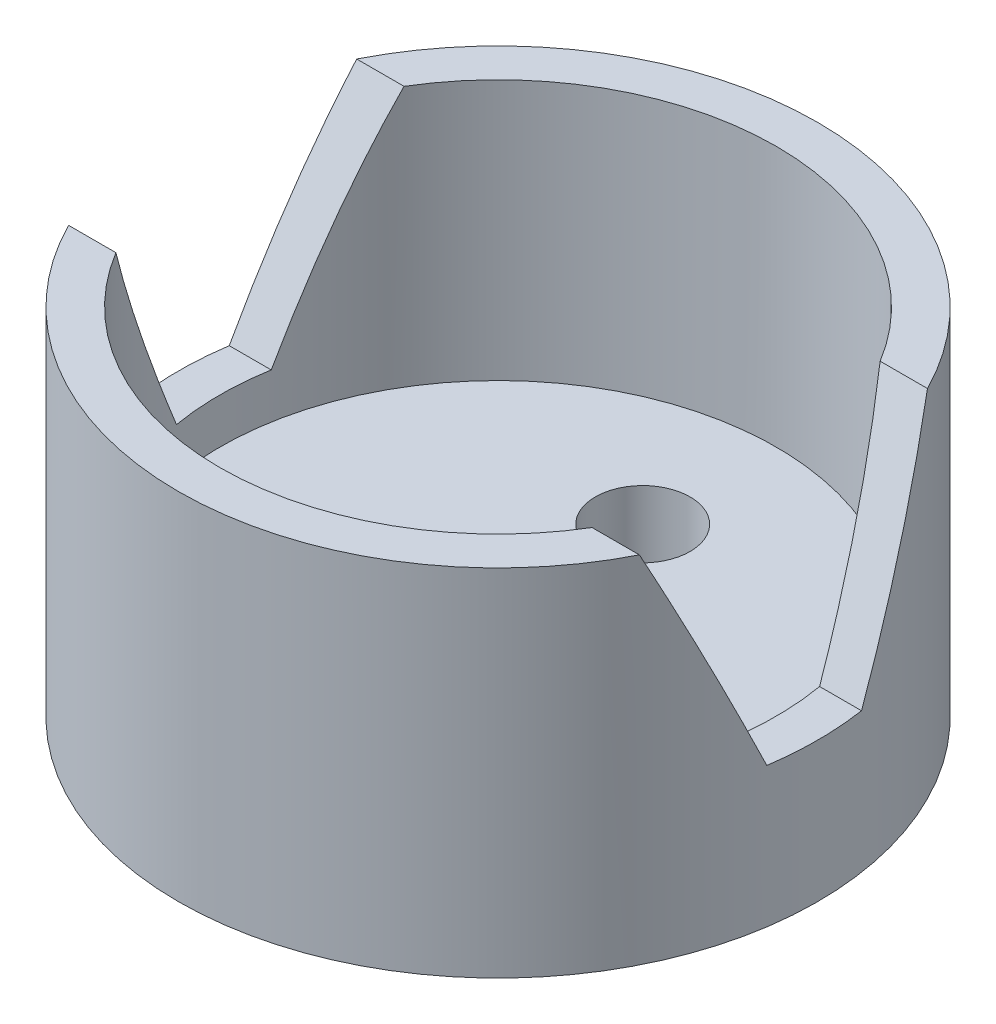
ISO-10303-21;
HEADER;
FILE_DESCRIPTION(('STEP AP214'),'2;1');
FILE_NAME('part.step','',(''),(''),'','','');
FILE_SCHEMA(('AUTOMOTIVE_DESIGN { 1 0 10303 214 1 1 1 1 }'));
ENDSEC;
DATA;
#1=APPLICATION_CONTEXT('core data for automotive mechanical design processes');
#2=APPLICATION_PROTOCOL_DEFINITION('international standard','automotive_design',2000,#1);
#3=PRODUCT_CONTEXT('',#1,'mechanical');
#4=PRODUCT('Part','Part','',(#3));
#5=PRODUCT_RELATED_PRODUCT_CATEGORY('part','',(#4));
#6=PRODUCT_DEFINITION_FORMATION('','',#4);
#7=PRODUCT_DEFINITION_CONTEXT('part definition',#1,'design');
#8=PRODUCT_DEFINITION('design','',#6,#7);
#9=PRODUCT_DEFINITION_SHAPE('','',#8);
#10=(LENGTH_UNIT() NAMED_UNIT(*) SI_UNIT(.MILLI.,.METRE.));
#11=(NAMED_UNIT(*) PLANE_ANGLE_UNIT() SI_UNIT($,.RADIAN.));
#12=(NAMED_UNIT(*) SI_UNIT($,.STERADIAN.) SOLID_ANGLE_UNIT());
#13=UNCERTAINTY_MEASURE_WITH_UNIT(LENGTH_MEASURE(1.E-05),#10,'distance_accuracy_value','');
#14=(GEOMETRIC_REPRESENTATION_CONTEXT(3) GLOBAL_UNCERTAINTY_ASSIGNED_CONTEXT((#13)) GLOBAL_UNIT_ASSIGNED_CONTEXT((#10,
#11,#12)) REPRESENTATION_CONTEXT('',''));
#15=CARTESIAN_POINT('',(0.,0.,0.));
#16=DIRECTION('',(0.,0.,1.));
#17=DIRECTION('',(1.,0.,0.));
#18=AXIS2_PLACEMENT_3D('',#15,#16,#17);
#19=CARTESIAN_POINT('',(0.,15.,0.));
#20=DIRECTION('',(0.,1.,0.));
#21=DIRECTION('',(0.,0.,1.));
#22=AXIS2_PLACEMENT_3D('',#19,#20,#21);
#23=PLANE('',#22);
#24=DIRECTION('',(1.,0.,0.));
#25=VECTOR('',#24,1.);
#26=CARTESIAN_POINT('',(-13.5,15.,-6.0831228610285));
#27=LINE('',#26,#25);
#28=CARTESIAN_POINT('',(10.0527665971927,15.,-6.0831228610285));
#29=VERTEX_POINT('',#28);
#30=CARTESIAN_POINT('',(12.0517889235429,15.,-6.0831228610285));
#31=VERTEX_POINT('',#30);
#32=EDGE_CURVE('E140',#29,#31,#27,.T.);
#33=ORIENTED_EDGE('',*,*,#32,.T.);
#34=CARTESIAN_POINT('',(0.,15.,0.));
#35=DIRECTION('',(0.,1.,0.));
#36=DIRECTION('',(0.,0.,1.));
#37=AXIS2_PLACEMENT_3D('',#34,#35,#36);
#38=CIRCLE('',#37,13.5);
#39=CARTESIAN_POINT('',(-12.0517889235429,15.,-6.0831228610285));
#40=VERTEX_POINT('',#39);
#41=EDGE_CURVE('E171',#31,#40,#38,.T.);
#42=ORIENTED_EDGE('',*,*,#41,.T.);
#43=CARTESIAN_POINT('',(-10.0527665971927,15.,-6.0831228610285));
#44=VERTEX_POINT('',#43);
#45=EDGE_CURVE('E135',#40,#44,#27,.T.);
#46=ORIENTED_EDGE('',*,*,#45,.T.);
#47=CARTESIAN_POINT('',(0.,15.,0.));
#48=DIRECTION('',(0.,1.,0.));
#49=DIRECTION('',(0.,0.,1.));
#50=AXIS2_PLACEMENT_3D('',#47,#48,#49);
#51=CIRCLE('',#50,11.75);
#52=EDGE_CURVE('E165',#29,#44,#51,.T.);
#53=ORIENTED_EDGE('',*,*,#52,.F.);
#54=EDGE_LOOP('',(#33,#42,#46,#53));
#55=FACE_BOUND('',#54,.T.);
#56=ADVANCED_FACE('F39',(#55),#23,.T.);
#57=CARTESIAN_POINT('',(0.,15.,0.));
#58=DIRECTION('',(0.,-1.,0.));
#59=DIRECTION('',(0.,0.,-1.));
#60=AXIS2_PLACEMENT_3D('',#57,#58,#59);
#61=CYLINDRICAL_SURFACE('',#60,13.5);
#62=ORIENTED_EDGE('',*,*,#41,.F.);
#63=CARTESIAN_POINT('',(0.,1.45377772708866,0.));
#64=DIRECTION('',(0.,-0.409654602258446,-0.91224070663859));
#65=DIRECTION('',(0.,-0.91224070663859,0.409654602258446));
#66=AXIS2_PLACEMENT_3D('',#63,#64,#65);
#67=ELLIPSE('',#66,32.9545913205267,13.5);
#68=CARTESIAN_POINT('',(13.3510299228187,5.90748434534395,-2.));
#69=VERTEX_POINT('',#68);
#70=EDGE_CURVE('E146',#31,#69,#67,.T.);
#71=ORIENTED_EDGE('',*,*,#70,.T.);
#72=CARTESIAN_POINT('',(0.,5.90748434534395,0.));
#73=DIRECTION('',(0.,-1.,0.));
#74=DIRECTION('',(0.,0.,-1.));
#75=AXIS2_PLACEMENT_3D('',#72,#73,#74);
#76=CIRCLE('',#75,13.5);
#77=CARTESIAN_POINT('',(13.3510299228187,5.90748434534395,2.));
#78=VERTEX_POINT('',#77);
#79=EDGE_CURVE('E119',#69,#78,#76,.T.);
#80=ORIENTED_EDGE('',*,*,#79,.T.);
#81=CARTESIAN_POINT('',(0.,1.45377772708866,0.));
#82=DIRECTION('',(0.,-0.409654602258446,0.91224070663859));
#83=DIRECTION('',(0.,-0.91224070663859,-0.409654602258446));
#84=AXIS2_PLACEMENT_3D('',#81,#82,#83);
#85=ELLIPSE('',#84,32.9545913205267,13.5);
#86=CARTESIAN_POINT('',(12.0517889235429,15.,6.0831228610285));
#87=VERTEX_POINT('',#86);
#88=EDGE_CURVE('E120',#78,#87,#85,.T.);
#89=ORIENTED_EDGE('',*,*,#88,.T.);
#90=CARTESIAN_POINT('',(-12.0517889235429,15.,6.0831228610285));
#91=VERTEX_POINT('',#90);
#92=EDGE_CURVE('E133',#91,#87,#38,.T.);
#93=ORIENTED_EDGE('',*,*,#92,.F.);
#94=CARTESIAN_POINT('',(-13.3510299228187,5.90748434534395,2.));
#95=VERTEX_POINT('',#94);
#96=EDGE_CURVE('E123',#91,#95,#85,.T.);
#97=ORIENTED_EDGE('',*,*,#96,.T.);
#98=CARTESIAN_POINT('',(-13.3510299228187,5.90748434534395,-2.));
#99=VERTEX_POINT('',#98);
#100=EDGE_CURVE('E107',#95,#99,#76,.T.);
#101=ORIENTED_EDGE('',*,*,#100,.T.);
#102=EDGE_CURVE('E150',#99,#40,#67,.T.);
#103=ORIENTED_EDGE('',*,*,#102,.T.);
#104=EDGE_LOOP('',(#62,#71,#80,#89,#93,#97,#101,#103));
#105=FACE_BOUND('',#104,.T.);
#106=CARTESIAN_POINT('',(0.,0.,0.));
#107=DIRECTION('',(0.,1.,0.));
#108=DIRECTION('',(0.,0.,1.));
#109=AXIS2_PLACEMENT_3D('',#106,#107,#108);
#110=CIRCLE('',#109,13.5);
#111=CARTESIAN_POINT('',(0.,0.,13.5));
#112=VERTEX_POINT('',#111);
#113=EDGE_CURVE('E164',#112,#112,#110,.T.);
#114=ORIENTED_EDGE('',*,*,#113,.T.);
#115=EDGE_LOOP('',(#114));
#116=FACE_BOUND('',#115,.T.);
#117=ADVANCED_FACE('F41',(#105,#116),#61,.T.);
#118=DIRECTION('',(1.,0.,0.));
#119=VECTOR('',#118,1.);
#120=CARTESIAN_POINT('',(-13.5,15.,6.0831228610285));
#121=LINE('',#120,#119);
#122=CARTESIAN_POINT('',(-10.0527665971927,15.,6.0831228610285));
#123=VERTEX_POINT('',#122);
#124=EDGE_CURVE('E64',#91,#123,#121,.T.);
#125=ORIENTED_EDGE('',*,*,#124,.F.);
#126=ORIENTED_EDGE('',*,*,#92,.T.);
#127=CARTESIAN_POINT('',(10.0527665971927,15.,6.0831228610285));
#128=VERTEX_POINT('',#127);
#129=EDGE_CURVE('E143',#128,#87,#121,.T.);
#130=ORIENTED_EDGE('',*,*,#129,.F.);
#131=EDGE_CURVE('E155',#123,#128,#51,.T.);
#132=ORIENTED_EDGE('',*,*,#131,.F.);
#133=EDGE_LOOP('',(#125,#126,#130,#132));
#134=FACE_BOUND('',#133,.T.);
#135=ADVANCED_FACE('F191',(#134),#23,.T.);
#136=CARTESIAN_POINT('',(0.,0.,0.));
#137=DIRECTION('',(0.,1.,0.));
#138=DIRECTION('',(0.,0.,1.));
#139=AXIS2_PLACEMENT_3D('',#136,#137,#138);
#140=PLANE('',#139);
#141=CARTESIAN_POINT('',(0.,0.,-6.10844107493398));
#142=DIRECTION('',(0.,1.,0.));
#143=DIRECTION('',(0.,0.,1.));
#144=AXIS2_PLACEMENT_3D('',#141,#142,#143);
#145=CIRCLE('',#144,2.);
#146=CARTESIAN_POINT('',(0.,0.,-4.10844107493398));
#147=VERTEX_POINT('',#146);
#148=EDGE_CURVE('E151',#147,#147,#145,.T.);
#149=ORIENTED_EDGE('',*,*,#148,.T.);
#150=EDGE_LOOP('',(#149));
#151=FACE_BOUND('',#150,.T.);
#152=ORIENTED_EDGE('',*,*,#113,.F.);
#153=EDGE_LOOP('',(#152));
#154=FACE_BOUND('',#153,.T.);
#155=ADVANCED_FACE('F218',(#151,#154),#140,.F.);
#156=CARTESIAN_POINT('',(0.,4.,0.));
#157=DIRECTION('',(0.,1.,0.));
#158=DIRECTION('',(0.,0.,1.));
#159=AXIS2_PLACEMENT_3D('',#156,#157,#158);
#160=CYLINDRICAL_SURFACE('',#159,11.75);
#161=CARTESIAN_POINT('',(0.,4.,0.));
#162=DIRECTION('',(0.,1.,0.));
#163=DIRECTION('',(0.,0.,1.));
#164=AXIS2_PLACEMENT_3D('',#161,#162,#163);
#165=CIRCLE('',#164,11.75);
#166=CARTESIAN_POINT('',(0.,4.,11.75));
#167=VERTEX_POINT('',#166);
#168=EDGE_CURVE('E160',#167,#167,#165,.T.);
#169=ORIENTED_EDGE('',*,*,#168,.F.);
#170=EDGE_LOOP('',(#169));
#171=FACE_BOUND('',#170,.T.);
#172=CARTESIAN_POINT('',(0.,5.90748434534395,0.));
#173=DIRECTION('',(0.,-1.,0.));
#174=DIRECTION('',(0.,0.,-1.));
#175=AXIS2_PLACEMENT_3D('',#172,#173,#174);
#176=CIRCLE('',#175,11.75);
#177=CARTESIAN_POINT('',(11.5785361769094,5.90748434534395,2.));
#178=VERTEX_POINT('',#177);
#179=CARTESIAN_POINT('',(11.5785361769094,5.90748434534395,-2.));
#180=VERTEX_POINT('',#179);
#181=EDGE_CURVE('E49',#178,#180,#176,.F.);
#182=ORIENTED_EDGE('',*,*,#181,.T.);
#183=CARTESIAN_POINT('',(0.,1.45377772708866,0.));
#184=DIRECTION('',(0.,-0.409654602258446,-0.91224070663859));
#185=DIRECTION('',(0.,0.91224070663859,-0.409654602258446));
#186=AXIS2_PLACEMENT_3D('',#183,#184,#185);
#187=ELLIPSE('',#186,28.682699853051,11.75);
#188=EDGE_CURVE('E11',#180,#29,#187,.F.);
#189=ORIENTED_EDGE('',*,*,#188,.T.);
#190=ORIENTED_EDGE('',*,*,#52,.T.);
#191=CARTESIAN_POINT('',(-11.5785361769094,5.90748434534395,-2.));
#192=VERTEX_POINT('',#191);
#193=EDGE_CURVE('E43',#44,#192,#187,.F.);
#194=ORIENTED_EDGE('',*,*,#193,.T.);
#195=CARTESIAN_POINT('',(-11.5785361769094,5.90748434534395,2.));
#196=VERTEX_POINT('',#195);
#197=EDGE_CURVE('E176',#192,#196,#176,.F.);
#198=ORIENTED_EDGE('',*,*,#197,.T.);
#199=CARTESIAN_POINT('',(0.,1.45377772708866,0.));
#200=DIRECTION('',(0.,-0.409654602258446,0.91224070663859));
#201=DIRECTION('',(0.,0.91224070663859,0.409654602258446));
#202=AXIS2_PLACEMENT_3D('',#199,#200,#201);
#203=ELLIPSE('',#202,28.682699853051,11.75);
#204=EDGE_CURVE('E124',#196,#123,#203,.F.);
#205=ORIENTED_EDGE('',*,*,#204,.T.);
#206=ORIENTED_EDGE('',*,*,#131,.T.);
#207=EDGE_CURVE('E177',#128,#178,#203,.F.);
#208=ORIENTED_EDGE('',*,*,#207,.T.);
#209=EDGE_LOOP('',(#182,#189,#190,#194,#198,#205,#206,#208));
#210=FACE_BOUND('',#209,.T.);
#211=ADVANCED_FACE('F186',(#171,#210),#160,.F.);
#212=CARTESIAN_POINT('',(0.,4.,0.));
#213=DIRECTION('',(0.,1.,0.));
#214=DIRECTION('',(0.,0.,1.));
#215=AXIS2_PLACEMENT_3D('',#212,#213,#214);
#216=PLANE('',#215);
#217=CARTESIAN_POINT('',(0.,4.,-6.10844107493398));
#218=DIRECTION('',(0.,1.,0.));
#219=DIRECTION('',(0.,0.,1.));
#220=AXIS2_PLACEMENT_3D('',#217,#218,#219);
#221=CIRCLE('',#220,2.);
#222=CARTESIAN_POINT('',(0.,4.,-4.10844107493398));
#223=VERTEX_POINT('',#222);
#224=EDGE_CURVE('E156',#223,#223,#221,.T.);
#225=ORIENTED_EDGE('',*,*,#224,.F.);
#226=EDGE_LOOP('',(#225));
#227=FACE_BOUND('',#226,.T.);
#228=ORIENTED_EDGE('',*,*,#168,.T.);
#229=EDGE_LOOP('',(#228));
#230=FACE_BOUND('',#229,.T.);
#231=ADVANCED_FACE('F226',(#227,#230),#216,.T.);
#232=CARTESIAN_POINT('',(0.,0.,-6.10844107493398));
#233=DIRECTION('',(0.,1.,0.));
#234=DIRECTION('',(0.,0.,1.));
#235=AXIS2_PLACEMENT_3D('',#232,#233,#234);
#236=CYLINDRICAL_SURFACE('',#235,2.);
#237=ORIENTED_EDGE('',*,*,#148,.F.);
#238=EDGE_LOOP('',(#237));
#239=FACE_BOUND('',#238,.T.);
#240=ORIENTED_EDGE('',*,*,#224,.T.);
#241=EDGE_LOOP('',(#240));
#242=FACE_BOUND('',#241,.T.);
#243=ADVANCED_FACE('F232',(#239,#242),#236,.F.);
#244=CARTESIAN_POINT('',(-13.5,5.90748434534395,2.));
#245=DIRECTION('',(0.,-0.409654602258446,0.91224070663859));
#246=DIRECTION('',(0.,-0.91224070663859,-0.409654602258446));
#247=AXIS2_PLACEMENT_3D('',#244,#245,#246);
#248=PLANE('',#247);
#249=ORIENTED_EDGE('',*,*,#124,.T.);
#250=ORIENTED_EDGE('',*,*,#204,.F.);
#251=DIRECTION('',(1.,0.,0.));
#252=VECTOR('',#251,1.);
#253=CARTESIAN_POINT('',(-13.5,5.90748434534395,2.));
#254=LINE('',#253,#252);
#255=EDGE_CURVE('E110',#95,#196,#254,.T.);
#256=ORIENTED_EDGE('',*,*,#255,.F.);
#257=ORIENTED_EDGE('',*,*,#96,.F.);
#258=EDGE_LOOP('',(#249,#250,#256,#257));
#259=FACE_BOUND('',#258,.T.);
#260=ADVANCED_FACE('F122',(#259),#248,.F.);
#261=CARTESIAN_POINT('',(-13.5,5.90748434534395,-2.));
#262=DIRECTION('',(0.,-1.,0.));
#263=DIRECTION('',(0.,0.,-1.));
#264=AXIS2_PLACEMENT_3D('',#261,#262,#263);
#265=PLANE('',#264);
#266=ORIENTED_EDGE('',*,*,#255,.T.);
#267=ORIENTED_EDGE('',*,*,#197,.F.);
#268=DIRECTION('',(1.,0.,0.));
#269=VECTOR('',#268,1.);
#270=CARTESIAN_POINT('',(-13.5,5.90748434534395,-2.));
#271=LINE('',#270,#269);
#272=EDGE_CURVE('E113',#99,#192,#271,.T.);
#273=ORIENTED_EDGE('',*,*,#272,.F.);
#274=ORIENTED_EDGE('',*,*,#100,.F.);
#275=EDGE_LOOP('',(#266,#267,#273,#274));
#276=FACE_BOUND('',#275,.T.);
#277=ADVANCED_FACE('F109',(#276),#265,.F.);
#278=CARTESIAN_POINT('',(-13.5,5.90748434534395,-2.));
#279=DIRECTION('',(0.,-0.409654602258446,-0.91224070663859));
#280=DIRECTION('',(0.,0.91224070663859,-0.409654602258446));
#281=AXIS2_PLACEMENT_3D('',#278,#279,#280);
#282=PLANE('',#281);
#283=ORIENTED_EDGE('',*,*,#272,.T.);
#284=ORIENTED_EDGE('',*,*,#193,.F.);
#285=ORIENTED_EDGE('',*,*,#45,.F.);
#286=ORIENTED_EDGE('',*,*,#102,.F.);
#287=EDGE_LOOP('',(#283,#284,#285,#286));
#288=FACE_BOUND('',#287,.T.);
#289=ADVANCED_FACE('F206',(#288),#282,.F.);
#290=ORIENTED_EDGE('',*,*,#32,.F.);
#291=ORIENTED_EDGE('',*,*,#188,.F.);
#292=EDGE_CURVE('E126',#180,#69,#271,.T.);
#293=ORIENTED_EDGE('',*,*,#292,.T.);
#294=ORIENTED_EDGE('',*,*,#70,.F.);
#295=EDGE_LOOP('',(#290,#291,#293,#294));
#296=FACE_BOUND('',#295,.T.);
#297=ADVANCED_FACE('F250',(#296),#282,.F.);
#298=ORIENTED_EDGE('',*,*,#292,.F.);
#299=ORIENTED_EDGE('',*,*,#181,.F.);
#300=EDGE_CURVE('E56',#178,#78,#254,.T.);
#301=ORIENTED_EDGE('',*,*,#300,.T.);
#302=ORIENTED_EDGE('',*,*,#79,.F.);
#303=EDGE_LOOP('',(#298,#299,#301,#302));
#304=FACE_BOUND('',#303,.T.);
#305=ADVANCED_FACE('F247',(#304),#265,.F.);
#306=ORIENTED_EDGE('',*,*,#300,.F.);
#307=ORIENTED_EDGE('',*,*,#207,.F.);
#308=ORIENTED_EDGE('',*,*,#129,.T.);
#309=ORIENTED_EDGE('',*,*,#88,.F.);
#310=EDGE_LOOP('',(#306,#307,#308,#309));
#311=FACE_BOUND('',#310,.T.);
#312=ADVANCED_FACE('F189',(#311),#248,.F.);
#313=CLOSED_SHELL('',(#56,#117,#135,#155,#211,#231,#243,#260,#277,#289,#297,#305,#312));
#314=MANIFOLD_SOLID_BREP('B2',#313);
#315=ADVANCED_BREP_SHAPE_REPRESENTATION('',(#18,#314),#14);
#316=SHAPE_DEFINITION_REPRESENTATION(#9,#315);
ENDSEC;
END-ISO-10303-21;
